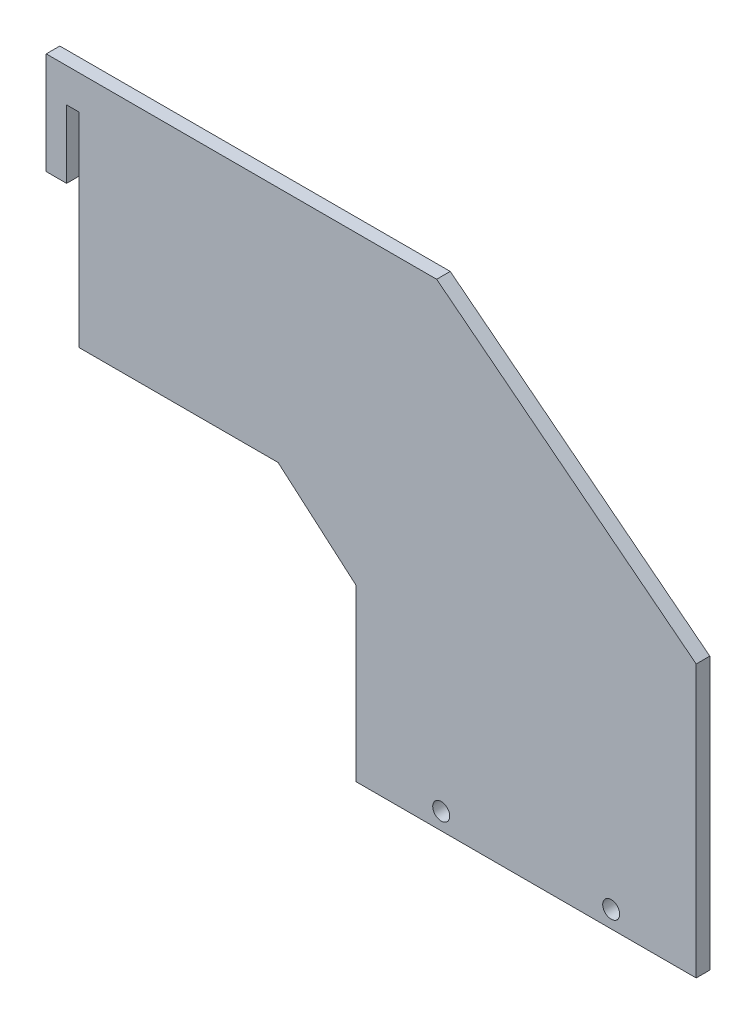
ISO-10303-21;
HEADER;
FILE_DESCRIPTION(('STEP AP214'),'2;1');
FILE_NAME('part.step','',(''),(''),'','','');
FILE_SCHEMA(('AUTOMOTIVE_DESIGN { 1 0 10303 214 1 1 1 1 }'));
ENDSEC;
DATA;
#1=APPLICATION_CONTEXT('core data for automotive mechanical design processes');
#2=APPLICATION_PROTOCOL_DEFINITION('international standard','automotive_design',2000,#1);
#3=PRODUCT_CONTEXT('',#1,'mechanical');
#4=PRODUCT('Part','Part','',(#3));
#5=PRODUCT_RELATED_PRODUCT_CATEGORY('part','',(#4));
#6=PRODUCT_DEFINITION_FORMATION('','',#4);
#7=PRODUCT_DEFINITION_CONTEXT('part definition',#1,'design');
#8=PRODUCT_DEFINITION('design','',#6,#7);
#9=PRODUCT_DEFINITION_SHAPE('','',#8);
#10=(LENGTH_UNIT() NAMED_UNIT(*) SI_UNIT(.MILLI.,.METRE.));
#11=(NAMED_UNIT(*) PLANE_ANGLE_UNIT() SI_UNIT($,.RADIAN.));
#12=(NAMED_UNIT(*) SI_UNIT($,.STERADIAN.) SOLID_ANGLE_UNIT());
#13=UNCERTAINTY_MEASURE_WITH_UNIT(LENGTH_MEASURE(1.E-05),#10,'distance_accuracy_value','');
#14=(GEOMETRIC_REPRESENTATION_CONTEXT(3) GLOBAL_UNCERTAINTY_ASSIGNED_CONTEXT((#13)) GLOBAL_UNIT_ASSIGNED_CONTEXT((#10,
#11,#12)) REPRESENTATION_CONTEXT('',''));
#15=CARTESIAN_POINT('',(0.,0.,0.));
#16=DIRECTION('',(0.,0.,1.));
#17=DIRECTION('',(1.,0.,0.));
#18=AXIS2_PLACEMENT_3D('',#15,#16,#17);
#19=CARTESIAN_POINT('',(87.1938267313852,-86.85055349062,4.));
#20=DIRECTION('',(-0.000219678045807747,0.999999975870778,0.));
#21=DIRECTION('',(-0.999999975870778,-0.000219678045807747,0.));
#22=AXIS2_PLACEMENT_3D('',#19,#20,#21);
#23=PLANE('',#22);
#24=DIRECTION('',(0.999999975870778,0.000219678045807747,0.));
#25=VECTOR('',#24,1.);
#26=CARTESIAN_POINT('',(87.1938267313852,-86.85055349062,0.));
#27=LINE('',#26,#25);
#28=CARTESIAN_POINT('',(87.1938267313852,-86.85055349062,0.));
#29=VERTEX_POINT('',#28);
#30=CARTESIAN_POINT('',(187.193824318463,-86.8285856860392,0.));
#31=VERTEX_POINT('',#30);
#32=EDGE_CURVE('E155',#29,#31,#27,.T.);
#33=ORIENTED_EDGE('',*,*,#32,.T.);
#34=DIRECTION('',(0.,0.,-1.));
#35=VECTOR('',#34,1.);
#36=CARTESIAN_POINT('',(187.193824318463,-86.8285856860392,4.));
#37=LINE('',#36,#35);
#38=CARTESIAN_POINT('',(187.193824318463,-86.8285856860392,4.));
#39=VERTEX_POINT('',#38);
#40=EDGE_CURVE('E11',#39,#31,#37,.T.);
#41=ORIENTED_EDGE('',*,*,#40,.F.);
#42=DIRECTION('',(0.999999975870778,0.000219678045807747,0.));
#43=VECTOR('',#42,1.);
#44=CARTESIAN_POINT('',(87.1938267313852,-86.85055349062,4.));
#45=LINE('',#44,#43);
#46=CARTESIAN_POINT('',(87.1938267313852,-86.85055349062,4.));
#47=VERTEX_POINT('',#46);
#48=EDGE_CURVE('E179',#47,#39,#45,.T.);
#49=ORIENTED_EDGE('',*,*,#48,.F.);
#50=DIRECTION('',(0.,0.,-1.));
#51=VECTOR('',#50,1.);
#52=CARTESIAN_POINT('',(87.1938267313852,-86.85055349062,4.));
#53=LINE('',#52,#51);
#54=EDGE_CURVE('E151',#47,#29,#53,.T.);
#55=ORIENTED_EDGE('',*,*,#54,.T.);
#56=EDGE_LOOP('',(#33,#41,#49,#55));
#57=FACE_BOUND('',#56,.T.);
#58=ADVANCED_FACE('F35',(#57),#23,.F.);
#59=CARTESIAN_POINT('',(187.193824318463,-86.8285856860392,4.));
#60=DIRECTION('',(-1.,0.,0.));
#61=DIRECTION('',(0.,0.,1.));
#62=AXIS2_PLACEMENT_3D('',#59,#60,#61);
#63=PLANE('',#62);
#64=DIRECTION('',(0.,1.,0.));
#65=VECTOR('',#64,1.);
#66=CARTESIAN_POINT('',(187.193824318463,-86.8285856860392,0.));
#67=LINE('',#66,#65);
#68=CARTESIAN_POINT('',(187.193824318463,-6.8285856860392,0.));
#69=VERTEX_POINT('',#68);
#70=EDGE_CURVE('E158',#31,#69,#67,.T.);
#71=ORIENTED_EDGE('',*,*,#70,.T.);
#72=DIRECTION('',(0.,0.,-1.));
#73=VECTOR('',#72,1.);
#74=CARTESIAN_POINT('',(187.193824318463,-6.8285856860392,4.));
#75=LINE('',#74,#73);
#76=CARTESIAN_POINT('',(187.193824318463,-6.8285856860392,4.));
#77=VERTEX_POINT('',#76);
#78=EDGE_CURVE('E43',#77,#69,#75,.T.);
#79=ORIENTED_EDGE('',*,*,#78,.F.);
#80=DIRECTION('',(0.,1.,0.));
#81=VECTOR('',#80,1.);
#82=CARTESIAN_POINT('',(187.193824318463,-86.8285856860392,4.));
#83=LINE('',#82,#81);
#84=EDGE_CURVE('E106',#39,#77,#83,.T.);
#85=ORIENTED_EDGE('',*,*,#84,.F.);
#86=ORIENTED_EDGE('',*,*,#40,.T.);
#87=EDGE_LOOP('',(#71,#79,#85,#86));
#88=FACE_BOUND('',#87,.T.);
#89=ADVANCED_FACE('F257',(#88),#63,.F.);
#90=CARTESIAN_POINT('',(110.849999999997,53.0017978863034,4.));
#91=DIRECTION('',(-0.616839077811203,-0.78708929104964,0.));
#92=DIRECTION('',(0.78708929104964,-0.616839077811203,0.));
#93=AXIS2_PLACEMENT_3D('',#90,#91,#92);
#94=PLANE('',#93);
#95=DIRECTION('',(-0.78708929104964,0.616839077811203,0.));
#96=VECTOR('',#95,1.);
#97=CARTESIAN_POINT('',(110.849999999997,53.0017978863034,0.));
#98=LINE('',#97,#96);
#99=CARTESIAN_POINT('',(110.849999999997,53.0017978863034,0.));
#100=VERTEX_POINT('',#99);
#101=EDGE_CURVE('E161',#69,#100,#98,.T.);
#102=ORIENTED_EDGE('',*,*,#101,.T.);
#103=DIRECTION('',(0.,0.,-1.));
#104=VECTOR('',#103,1.);
#105=CARTESIAN_POINT('',(110.849999999997,53.0017978863034,4.));
#106=LINE('',#105,#104);
#107=CARTESIAN_POINT('',(110.849999999997,53.0017978863034,4.));
#108=VERTEX_POINT('',#107);
#109=EDGE_CURVE('E198',#108,#100,#106,.T.);
#110=ORIENTED_EDGE('',*,*,#109,.F.);
#111=DIRECTION('',(-0.78708929104964,0.616839077811203,0.));
#112=VECTOR('',#111,1.);
#113=CARTESIAN_POINT('',(110.849999999997,53.0017978863034,4.));
#114=LINE('',#113,#112);
#115=EDGE_CURVE('E206',#77,#108,#114,.T.);
#116=ORIENTED_EDGE('',*,*,#115,.F.);
#117=ORIENTED_EDGE('',*,*,#78,.T.);
#118=EDGE_LOOP('',(#102,#110,#116,#117));
#119=FACE_BOUND('',#118,.T.);
#120=ADVANCED_FACE('F204',(#119),#94,.F.);
#121=CARTESIAN_POINT('',(5.99999999999995,53.0017978863034,4.));
#122=DIRECTION('',(0.,-1.,0.));
#123=DIRECTION('',(1.,0.,0.));
#124=AXIS2_PLACEMENT_3D('',#121,#122,#123);
#125=PLANE('',#124);
#126=DIRECTION('',(-1.,0.,0.));
#127=VECTOR('',#126,1.);
#128=CARTESIAN_POINT('',(5.99999999999995,53.0017978863034,0.));
#129=LINE('',#128,#127);
#130=CARTESIAN_POINT('',(-4.00000000000005,53.0017978863034,0.));
#131=VERTEX_POINT('',#130);
#132=EDGE_CURVE('E164',#100,#131,#129,.T.);
#133=ORIENTED_EDGE('',*,*,#132,.T.);
#134=DIRECTION('',(0.,0.,-1.));
#135=VECTOR('',#134,1.);
#136=CARTESIAN_POINT('',(-4.00000000000005,53.0017978863034,4.));
#137=LINE('',#136,#135);
#138=CARTESIAN_POINT('',(-4.00000000000005,53.0017978863034,4.));
#139=VERTEX_POINT('',#138);
#140=EDGE_CURVE('E195',#139,#131,#137,.T.);
#141=ORIENTED_EDGE('',*,*,#140,.F.);
#142=DIRECTION('',(-1.,0.,0.));
#143=VECTOR('',#142,1.);
#144=CARTESIAN_POINT('',(110.849999999997,53.0017978863034,4.));
#145=LINE('',#144,#143);
#146=EDGE_CURVE('E223',#108,#139,#145,.T.);
#147=ORIENTED_EDGE('',*,*,#146,.F.);
#148=ORIENTED_EDGE('',*,*,#109,.T.);
#149=EDGE_LOOP('',(#133,#141,#147,#148));
#150=FACE_BOUND('',#149,.T.);
#151=ADVANCED_FACE('F214',(#150),#125,.F.);
#152=CARTESIAN_POINT('',(-4.00000000000005,53.0017978863034,4.));
#153=DIRECTION('',(1.,0.,0.));
#154=DIRECTION('',(0.,1.,0.));
#155=AXIS2_PLACEMENT_3D('',#152,#153,#154);
#156=PLANE('',#155);
#157=DIRECTION('',(0.,-1.,0.));
#158=VECTOR('',#157,1.);
#159=CARTESIAN_POINT('',(-4.00000000000005,53.0017978863034,0.));
#160=LINE('',#159,#158);
#161=CARTESIAN_POINT('',(-4.00000000000007,23.0017978863034,0.));
#162=VERTEX_POINT('',#161);
#163=EDGE_CURVE('E166',#131,#162,#160,.T.);
#164=ORIENTED_EDGE('',*,*,#163,.T.);
#165=DIRECTION('',(0.,0.,-1.));
#166=VECTOR('',#165,1.);
#167=CARTESIAN_POINT('',(-4.00000000000007,23.0017978863034,4.));
#168=LINE('',#167,#166);
#169=CARTESIAN_POINT('',(-4.00000000000007,23.0017978863034,4.));
#170=VERTEX_POINT('',#169);
#171=EDGE_CURVE('E192',#170,#162,#168,.T.);
#172=ORIENTED_EDGE('',*,*,#171,.F.);
#173=DIRECTION('',(0.,-1.,0.));
#174=VECTOR('',#173,1.);
#175=CARTESIAN_POINT('',(-4.00000000000005,53.0017978863034,4.));
#176=LINE('',#175,#174);
#177=EDGE_CURVE('E220',#139,#170,#176,.T.);
#178=ORIENTED_EDGE('',*,*,#177,.F.);
#179=ORIENTED_EDGE('',*,*,#140,.T.);
#180=EDGE_LOOP('',(#164,#172,#178,#179));
#181=FACE_BOUND('',#180,.T.);
#182=ADVANCED_FACE('F218',(#181),#156,.F.);
#183=CARTESIAN_POINT('',(-4.00000000000007,23.0017978863034,4.));
#184=DIRECTION('',(0.,1.,0.));
#185=DIRECTION('',(0.,0.,1.));
#186=AXIS2_PLACEMENT_3D('',#183,#184,#185);
#187=PLANE('',#186);
#188=DIRECTION('',(1.,0.,0.));
#189=VECTOR('',#188,1.);
#190=CARTESIAN_POINT('',(-4.00000000000007,23.0017978863034,0.));
#191=LINE('',#190,#189);
#192=CARTESIAN_POINT('',(1.99999999999995,23.0017978863034,0.));
#193=VERTEX_POINT('',#192);
#194=EDGE_CURVE('E168',#162,#193,#191,.T.);
#195=ORIENTED_EDGE('',*,*,#194,.T.);
#196=DIRECTION('',(0.,0.,-1.));
#197=VECTOR('',#196,1.);
#198=CARTESIAN_POINT('',(1.99999999999995,23.0017978863034,4.));
#199=LINE('',#198,#197);
#200=CARTESIAN_POINT('',(1.99999999999995,23.0017978863034,4.));
#201=VERTEX_POINT('',#200);
#202=EDGE_CURVE('E189',#201,#193,#199,.T.);
#203=ORIENTED_EDGE('',*,*,#202,.F.);
#204=DIRECTION('',(1.,0.,0.));
#205=VECTOR('',#204,1.);
#206=CARTESIAN_POINT('',(-4.00000000000007,23.0017978863034,4.));
#207=LINE('',#206,#205);
#208=EDGE_CURVE('E222',#170,#201,#207,.T.);
#209=ORIENTED_EDGE('',*,*,#208,.F.);
#210=ORIENTED_EDGE('',*,*,#171,.T.);
#211=EDGE_LOOP('',(#195,#203,#209,#210));
#212=FACE_BOUND('',#211,.T.);
#213=ADVANCED_FACE('F270',(#212),#187,.F.);
#214=CARTESIAN_POINT('',(1.99999999999995,23.0017978863034,4.));
#215=DIRECTION('',(-1.,0.,0.));
#216=DIRECTION('',(0.,0.,1.));
#217=AXIS2_PLACEMENT_3D('',#214,#215,#216);
#218=PLANE('',#217);
#219=DIRECTION('',(0.,1.,0.));
#220=VECTOR('',#219,1.);
#221=CARTESIAN_POINT('',(1.99999999999995,23.0017978863034,0.));
#222=LINE('',#221,#220);
#223=CARTESIAN_POINT('',(1.99999999999995,43.0017978863034,0.));
#224=VERTEX_POINT('',#223);
#225=EDGE_CURVE('E170',#193,#224,#222,.T.);
#226=ORIENTED_EDGE('',*,*,#225,.T.);
#227=DIRECTION('',(0.,0.,-1.));
#228=VECTOR('',#227,1.);
#229=CARTESIAN_POINT('',(1.99999999999995,43.0017978863034,4.));
#230=LINE('',#229,#228);
#231=CARTESIAN_POINT('',(1.99999999999995,43.0017978863034,4.));
#232=VERTEX_POINT('',#231);
#233=EDGE_CURVE('E186',#232,#224,#230,.T.);
#234=ORIENTED_EDGE('',*,*,#233,.F.);
#235=DIRECTION('',(0.,1.,0.));
#236=VECTOR('',#235,1.);
#237=CARTESIAN_POINT('',(1.99999999999995,23.0017978863034,4.));
#238=LINE('',#237,#236);
#239=EDGE_CURVE('E225',#201,#232,#238,.T.);
#240=ORIENTED_EDGE('',*,*,#239,.F.);
#241=ORIENTED_EDGE('',*,*,#202,.T.);
#242=EDGE_LOOP('',(#226,#234,#240,#241));
#243=FACE_BOUND('',#242,.T.);
#244=ADVANCED_FACE('F273',(#243),#218,.F.);
#245=CARTESIAN_POINT('',(1.99999999999995,43.0017978863034,4.));
#246=DIRECTION('',(0.,1.,0.));
#247=DIRECTION('',(0.,0.,1.));
#248=AXIS2_PLACEMENT_3D('',#245,#246,#247);
#249=PLANE('',#248);
#250=DIRECTION('',(1.,0.,0.));
#251=VECTOR('',#250,1.);
#252=CARTESIAN_POINT('',(1.99999999999995,43.0017978863034,0.));
#253=LINE('',#252,#251);
#254=CARTESIAN_POINT('',(5.71144902522184,43.0017978863034,0.));
#255=VERTEX_POINT('',#254);
#256=EDGE_CURVE('E172',#224,#255,#253,.T.);
#257=ORIENTED_EDGE('',*,*,#256,.T.);
#258=DIRECTION('',(0.,0.,-1.));
#259=VECTOR('',#258,1.);
#260=CARTESIAN_POINT('',(5.71144902522184,43.0017978863034,4.));
#261=LINE('',#260,#259);
#262=CARTESIAN_POINT('',(5.71144902522184,43.0017978863034,4.));
#263=VERTEX_POINT('',#262);
#264=EDGE_CURVE('E183',#263,#255,#261,.T.);
#265=ORIENTED_EDGE('',*,*,#264,.F.);
#266=DIRECTION('',(1.,0.,0.));
#267=VECTOR('',#266,1.);
#268=CARTESIAN_POINT('',(1.99999999999995,43.0017978863034,4.));
#269=LINE('',#268,#267);
#270=EDGE_CURVE('E231',#232,#263,#269,.T.);
#271=ORIENTED_EDGE('',*,*,#270,.F.);
#272=ORIENTED_EDGE('',*,*,#233,.T.);
#273=EDGE_LOOP('',(#257,#265,#271,#272));
#274=FACE_BOUND('',#273,.T.);
#275=ADVANCED_FACE('F237',(#274),#249,.F.);
#276=CARTESIAN_POINT('',(5.71144902522184,43.0017978863034,4.));
#277=DIRECTION('',(1.,0.,0.));
#278=DIRECTION('',(0.,1.,0.));
#279=AXIS2_PLACEMENT_3D('',#276,#277,#278);
#280=PLANE('',#279);
#281=DIRECTION('',(0.,-1.,0.));
#282=VECTOR('',#281,1.);
#283=CARTESIAN_POINT('',(5.71144902522184,43.0017978863034,0.));
#284=LINE('',#283,#282);
#285=CARTESIAN_POINT('',(5.71144902522183,-16.9982021136966,0.));
#286=VERTEX_POINT('',#285);
#287=EDGE_CURVE('E174',#255,#286,#284,.T.);
#288=ORIENTED_EDGE('',*,*,#287,.T.);
#289=DIRECTION('',(0.,0.,-1.));
#290=VECTOR('',#289,1.);
#291=CARTESIAN_POINT('',(5.71144902522183,-16.9982021136966,4.));
#292=LINE('',#291,#290);
#293=CARTESIAN_POINT('',(5.71144902522183,-16.9982021136966,4.));
#294=VERTEX_POINT('',#293);
#295=EDGE_CURVE('E146',#294,#286,#292,.T.);
#296=ORIENTED_EDGE('',*,*,#295,.F.);
#297=DIRECTION('',(0.,-1.,0.));
#298=VECTOR('',#297,1.);
#299=CARTESIAN_POINT('',(5.71144902522184,43.0017978863034,4.));
#300=LINE('',#299,#298);
#301=EDGE_CURVE('E137',#263,#294,#300,.T.);
#302=ORIENTED_EDGE('',*,*,#301,.F.);
#303=ORIENTED_EDGE('',*,*,#264,.T.);
#304=EDGE_LOOP('',(#288,#296,#302,#303));
#305=FACE_BOUND('',#304,.T.);
#306=ADVANCED_FACE('F241',(#305),#280,.F.);
#307=CARTESIAN_POINT('',(5.71144902522183,-16.9982021136966,4.));
#308=DIRECTION('',(0.,1.,0.));
#309=DIRECTION('',(0.,0.,1.));
#310=AXIS2_PLACEMENT_3D('',#307,#308,#309);
#311=PLANE('',#310);
#312=DIRECTION('',(1.,0.,0.));
#313=VECTOR('',#312,1.);
#314=CARTESIAN_POINT('',(5.71144902522183,-16.9982021136966,0.));
#315=LINE('',#314,#313);
#316=CARTESIAN_POINT('',(64.2083256531588,-16.9982021136966,0.));
#317=VERTEX_POINT('',#316);
#318=EDGE_CURVE('E145',#286,#317,#315,.T.);
#319=ORIENTED_EDGE('',*,*,#318,.T.);
#320=DIRECTION('',(0.,0.,-1.));
#321=VECTOR('',#320,1.);
#322=CARTESIAN_POINT('',(64.2083256531588,-16.9982021136966,4.));
#323=LINE('',#322,#321);
#324=CARTESIAN_POINT('',(64.2083256531588,-16.9982021136966,4.));
#325=VERTEX_POINT('',#324);
#326=EDGE_CURVE('E142',#325,#317,#323,.T.);
#327=ORIENTED_EDGE('',*,*,#326,.F.);
#328=DIRECTION('',(1.,0.,0.));
#329=VECTOR('',#328,1.);
#330=CARTESIAN_POINT('',(5.71144902522183,-16.9982021136966,4.));
#331=LINE('',#330,#329);
#332=EDGE_CURVE('E131',#294,#325,#331,.T.);
#333=ORIENTED_EDGE('',*,*,#332,.F.);
#334=ORIENTED_EDGE('',*,*,#295,.T.);
#335=EDGE_LOOP('',(#319,#327,#333,#334));
#336=FACE_BOUND('',#335,.T.);
#337=ADVANCED_FACE('F143',(#336),#311,.F.);
#338=CARTESIAN_POINT('',(64.2083256531588,-16.9982021136966,4.));
#339=DIRECTION('',(0.653643194958107,0.756802863158537,0.));
#340=DIRECTION('',(-0.756802863158536,0.653643194958107,0.));
#341=AXIS2_PLACEMENT_3D('',#338,#339,#340);
#342=PLANE('',#341);
#343=DIRECTION('',(0.756802863158536,-0.653643194958107,0.));
#344=VECTOR('',#343,1.);
#345=CARTESIAN_POINT('',(64.2083256531588,-16.9982021136966,0.));
#346=LINE('',#345,#344);
#347=CARTESIAN_POINT('',(87.1938267313852,-36.85055349062,0.));
#348=VERTEX_POINT('',#347);
#349=EDGE_CURVE('E92',#317,#348,#346,.T.);
#350=ORIENTED_EDGE('',*,*,#349,.T.);
#351=DIRECTION('',(0.,0.,-1.));
#352=VECTOR('',#351,1.);
#353=CARTESIAN_POINT('',(87.1938267313852,-36.85055349062,4.));
#354=LINE('',#353,#352);
#355=CARTESIAN_POINT('',(87.1938267313852,-36.85055349062,4.));
#356=VERTEX_POINT('',#355);
#357=EDGE_CURVE('E147',#356,#348,#354,.T.);
#358=ORIENTED_EDGE('',*,*,#357,.F.);
#359=DIRECTION('',(0.756802863158536,-0.653643194958107,0.));
#360=VECTOR('',#359,1.);
#361=CARTESIAN_POINT('',(64.2083256531588,-16.9982021136966,4.));
#362=LINE('',#361,#360);
#363=EDGE_CURVE('E135',#325,#356,#362,.T.);
#364=ORIENTED_EDGE('',*,*,#363,.F.);
#365=ORIENTED_EDGE('',*,*,#326,.T.);
#366=EDGE_LOOP('',(#350,#358,#364,#365));
#367=FACE_BOUND('',#366,.T.);
#368=ADVANCED_FACE('F149',(#367),#342,.F.);
#369=CARTESIAN_POINT('',(87.1938267313852,-36.85055349062,4.));
#370=DIRECTION('',(1.,0.,0.));
#371=DIRECTION('',(0.,1.,0.));
#372=AXIS2_PLACEMENT_3D('',#369,#370,#371);
#373=PLANE('',#372);
#374=DIRECTION('',(0.,-1.,0.));
#375=VECTOR('',#374,1.);
#376=CARTESIAN_POINT('',(87.1938267313852,-36.85055349062,0.));
#377=LINE('',#376,#375);
#378=EDGE_CURVE('E98',#348,#29,#377,.T.);
#379=ORIENTED_EDGE('',*,*,#378,.T.);
#380=ORIENTED_EDGE('',*,*,#54,.F.);
#381=DIRECTION('',(0.,-1.,0.));
#382=VECTOR('',#381,1.);
#383=CARTESIAN_POINT('',(87.1938267313852,-36.85055349062,4.));
#384=LINE('',#383,#382);
#385=EDGE_CURVE('E51',#356,#47,#384,.T.);
#386=ORIENTED_EDGE('',*,*,#385,.F.);
#387=ORIENTED_EDGE('',*,*,#357,.T.);
#388=EDGE_LOOP('',(#379,#380,#386,#387));
#389=FACE_BOUND('',#388,.T.);
#390=ADVANCED_FACE('F245',(#389),#373,.F.);
#391=CARTESIAN_POINT('',(0.,0.,4.));
#392=DIRECTION('',(0.,0.,1.));
#393=DIRECTION('',(1.,0.,0.));
#394=AXIS2_PLACEMENT_3D('',#391,#392,#393);
#395=PLANE('',#394);
#396=CARTESIAN_POINT('',(162.194900790092,-81.85055349062,4.));
#397=DIRECTION('',(0.,0.,1.));
#398=DIRECTION('',(1.,0.,0.));
#399=AXIS2_PLACEMENT_3D('',#396,#397,#398);
#400=CIRCLE('',#399,2.5);
#401=CARTESIAN_POINT('',(164.694900790092,-81.85055349062,4.));
#402=VERTEX_POINT('',#401);
#403=EDGE_CURVE('E339',#402,#402,#400,.T.);
#404=ORIENTED_EDGE('',*,*,#403,.F.);
#405=EDGE_LOOP('',(#404));
#406=FACE_BOUND('',#405,.T.);
#407=CARTESIAN_POINT('',(112.194900790092,-81.85055349062,4.));
#408=DIRECTION('',(0.,0.,1.));
#409=DIRECTION('',(1.,0.,0.));
#410=AXIS2_PLACEMENT_3D('',#407,#408,#409);
#411=CIRCLE('',#410,2.5);
#412=CARTESIAN_POINT('',(114.694900790092,-81.85055349062,4.));
#413=VERTEX_POINT('',#412);
#414=EDGE_CURVE('E341',#413,#413,#411,.T.);
#415=ORIENTED_EDGE('',*,*,#414,.F.);
#416=EDGE_LOOP('',(#415));
#417=FACE_BOUND('',#416,.T.);
#418=ORIENTED_EDGE('',*,*,#48,.T.);
#419=ORIENTED_EDGE('',*,*,#84,.T.);
#420=ORIENTED_EDGE('',*,*,#115,.T.);
#421=ORIENTED_EDGE('',*,*,#146,.T.);
#422=ORIENTED_EDGE('',*,*,#177,.T.);
#423=ORIENTED_EDGE('',*,*,#208,.T.);
#424=ORIENTED_EDGE('',*,*,#239,.T.);
#425=ORIENTED_EDGE('',*,*,#270,.T.);
#426=ORIENTED_EDGE('',*,*,#301,.T.);
#427=ORIENTED_EDGE('',*,*,#332,.T.);
#428=ORIENTED_EDGE('',*,*,#363,.T.);
#429=ORIENTED_EDGE('',*,*,#385,.T.);
#430=EDGE_LOOP('',(#418,#419,#420,#421,#422,#423,#424,#425,#426,#427,#428,#429));
#431=FACE_BOUND('',#430,.T.);
#432=ADVANCED_FACE('F133',(#406,#417,#431),#395,.T.);
#433=CARTESIAN_POINT('',(0.,0.,0.));
#434=DIRECTION('',(0.,0.,1.));
#435=DIRECTION('',(1.,0.,0.));
#436=AXIS2_PLACEMENT_3D('',#433,#434,#435);
#437=PLANE('',#436);
#438=CARTESIAN_POINT('',(162.194900790092,-81.85055349062,0.));
#439=DIRECTION('',(0.,0.,1.));
#440=DIRECTION('',(1.,0.,0.));
#441=AXIS2_PLACEMENT_3D('',#438,#439,#440);
#442=CIRCLE('',#441,2.5);
#443=CARTESIAN_POINT('',(164.694900790092,-81.85055349062,0.));
#444=VERTEX_POINT('',#443);
#445=EDGE_CURVE('E336',#444,#444,#442,.T.);
#446=ORIENTED_EDGE('',*,*,#445,.T.);
#447=EDGE_LOOP('',(#446));
#448=FACE_BOUND('',#447,.T.);
#449=CARTESIAN_POINT('',(112.194900790092,-81.85055349062,0.));
#450=DIRECTION('',(0.,0.,1.));
#451=DIRECTION('',(1.,0.,0.));
#452=AXIS2_PLACEMENT_3D('',#449,#450,#451);
#453=CIRCLE('',#452,2.5);
#454=CARTESIAN_POINT('',(114.694900790092,-81.85055349062,0.));
#455=VERTEX_POINT('',#454);
#456=EDGE_CURVE('E159',#455,#455,#453,.T.);
#457=ORIENTED_EDGE('',*,*,#456,.T.);
#458=EDGE_LOOP('',(#457));
#459=FACE_BOUND('',#458,.T.);
#460=ORIENTED_EDGE('',*,*,#32,.F.);
#461=ORIENTED_EDGE('',*,*,#378,.F.);
#462=ORIENTED_EDGE('',*,*,#349,.F.);
#463=ORIENTED_EDGE('',*,*,#318,.F.);
#464=ORIENTED_EDGE('',*,*,#287,.F.);
#465=ORIENTED_EDGE('',*,*,#256,.F.);
#466=ORIENTED_EDGE('',*,*,#225,.F.);
#467=ORIENTED_EDGE('',*,*,#194,.F.);
#468=ORIENTED_EDGE('',*,*,#163,.F.);
#469=ORIENTED_EDGE('',*,*,#132,.F.);
#470=ORIENTED_EDGE('',*,*,#101,.F.);
#471=ORIENTED_EDGE('',*,*,#70,.F.);
#472=EDGE_LOOP('',(#460,#461,#462,#463,#464,#465,#466,#467,#468,#469,#470,#471));
#473=FACE_BOUND('',#472,.T.);
#474=ADVANCED_FACE('F209',(#448,#459,#473),#437,.F.);
#475=CARTESIAN_POINT('',(112.194900790092,-81.85055349062,0.));
#476=DIRECTION('',(0.,0.,1.));
#477=DIRECTION('',(1.,0.,0.));
#478=AXIS2_PLACEMENT_3D('',#475,#476,#477);
#479=CYLINDRICAL_SURFACE('',#478,2.5);
#480=ORIENTED_EDGE('',*,*,#456,.F.);
#481=EDGE_LOOP('',(#480));
#482=FACE_BOUND('',#481,.T.);
#483=ORIENTED_EDGE('',*,*,#414,.T.);
#484=EDGE_LOOP('',(#483));
#485=FACE_BOUND('',#484,.T.);
#486=ADVANCED_FACE('F310',(#482,#485),#479,.F.);
#487=CARTESIAN_POINT('',(162.194900790092,-81.85055349062,0.));
#488=DIRECTION('',(0.,0.,1.));
#489=DIRECTION('',(1.,0.,0.));
#490=AXIS2_PLACEMENT_3D('',#487,#488,#489);
#491=CYLINDRICAL_SURFACE('',#490,2.5);
#492=ORIENTED_EDGE('',*,*,#445,.F.);
#493=EDGE_LOOP('',(#492));
#494=FACE_BOUND('',#493,.T.);
#495=ORIENTED_EDGE('',*,*,#403,.T.);
#496=EDGE_LOOP('',(#495));
#497=FACE_BOUND('',#496,.T.);
#498=ADVANCED_FACE('F319',(#494,#497),#491,.F.);
#499=CLOSED_SHELL('',(#58,#89,#120,#151,#182,#213,#244,#275,#306,#337,#368,#390,#432,#474,#486,#498));
#500=MANIFOLD_SOLID_BREP('B2',#499);
#501=ADVANCED_BREP_SHAPE_REPRESENTATION('',(#18,#500),#14);
#502=SHAPE_DEFINITION_REPRESENTATION(#9,#501);
ENDSEC;
END-ISO-10303-21;
